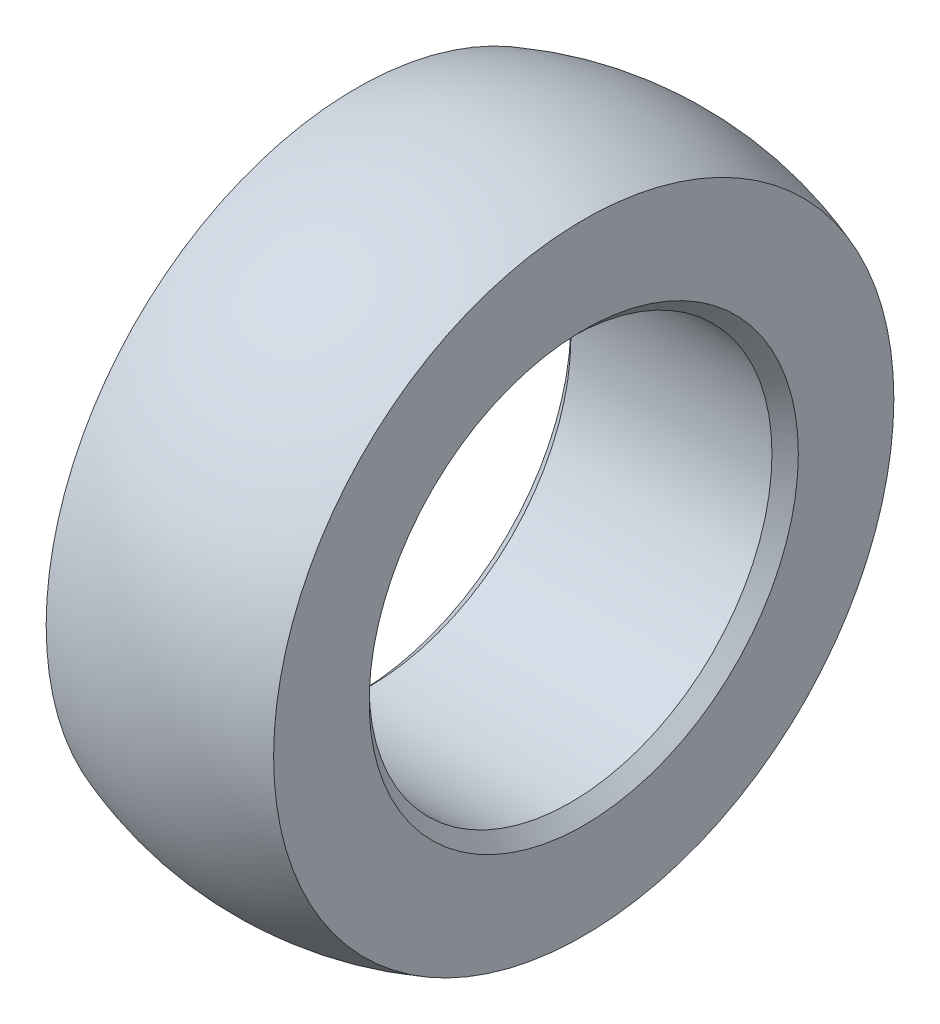
ISO-10303-21;
HEADER;
FILE_DESCRIPTION(('STEP AP214'),'2;1');
FILE_NAME('part.step','',(''),(''),'','','');
FILE_SCHEMA(('AUTOMOTIVE_DESIGN { 1 0 10303 214 1 1 1 1 }'));
ENDSEC;
DATA;
#1=APPLICATION_CONTEXT('core data for automotive mechanical design processes');
#2=APPLICATION_PROTOCOL_DEFINITION('international standard','automotive_design',2000,#1);
#3=PRODUCT_CONTEXT('',#1,'mechanical');
#4=PRODUCT('Part','Part','',(#3));
#5=PRODUCT_RELATED_PRODUCT_CATEGORY('part','',(#4));
#6=PRODUCT_DEFINITION_FORMATION('','',#4);
#7=PRODUCT_DEFINITION_CONTEXT('part definition',#1,'design');
#8=PRODUCT_DEFINITION('design','',#6,#7);
#9=PRODUCT_DEFINITION_SHAPE('','',#8);
#10=(LENGTH_UNIT() NAMED_UNIT(*) SI_UNIT(.MILLI.,.METRE.));
#11=(NAMED_UNIT(*) PLANE_ANGLE_UNIT() SI_UNIT($,.RADIAN.));
#12=(NAMED_UNIT(*) SI_UNIT($,.STERADIAN.) SOLID_ANGLE_UNIT());
#13=UNCERTAINTY_MEASURE_WITH_UNIT(LENGTH_MEASURE(1.E-05),#10,'distance_accuracy_value','');
#14=(GEOMETRIC_REPRESENTATION_CONTEXT(3) GLOBAL_UNCERTAINTY_ASSIGNED_CONTEXT((#13)) GLOBAL_UNIT_ASSIGNED_CONTEXT((#10,
#11,#12)) REPRESENTATION_CONTEXT('',''));
#15=CARTESIAN_POINT('',(0.,0.,0.));
#16=DIRECTION('',(0.,0.,1.));
#17=DIRECTION('',(1.,0.,0.));
#18=AXIS2_PLACEMENT_3D('',#15,#16,#17);
#19=CARTESIAN_POINT('',(4.3815,-12.0906797048,-12.0906797048));
#20=DIRECTION('',(-1.,0.,0.));
#21=DIRECTION('',(0.,0.,1.));
#22=AXIS2_PLACEMENT_3D('',#19,#20,#21);
#23=PLANE('',#22);
#24=CARTESIAN_POINT('',(4.38149999999993,0.,0.));
#25=DIRECTION('',(1.,0.,0.));
#26=DIRECTION('',(0.,0.,-1.));
#27=AXIS2_PLACEMENT_3D('',#24,#25,#26);
#28=CIRCLE('',#27,8.26769999999993);
#29=CARTESIAN_POINT('',(4.38149999999993,0.,-8.26769999999993));
#30=VERTEX_POINT('',#29);
#31=EDGE_CURVE('E18',#30,#30,#28,.T.);
#32=ORIENTED_EDGE('',*,*,#31,.F.);
#33=EDGE_LOOP('',(#32));
#34=FACE_BOUND('',#33,.T.);
#35=CARTESIAN_POINT('',(4.3815,0.,0.));
#36=DIRECTION('',(-1.,0.,0.));
#37=DIRECTION('',(0.,0.,1.));
#38=AXIS2_PLACEMENT_3D('',#35,#36,#37);
#39=CIRCLE('',#38,11.9473119533224);
#40=CARTESIAN_POINT('',(4.3815,0.,11.9473119533224));
#41=VERTEX_POINT('',#40);
#42=EDGE_CURVE('E33',#41,#41,#39,.F.);
#43=ORIENTED_EDGE('',*,*,#42,.T.);
#44=EDGE_LOOP('',(#43));
#45=FACE_BOUND('',#44,.T.);
#46=ADVANCED_FACE('F14',(#34,#45),#23,.F.);
#47=CARTESIAN_POINT('',(3.8735,0.,0.));
#48=DIRECTION('',(1.,0.,0.));
#49=DIRECTION('',(0.,0.,-1.));
#50=AXIS2_PLACEMENT_3D('',#47,#48,#49);
#51=CONICAL_SURFACE('',#50,7.7597,0.785398163397449);
#52=ORIENTED_EDGE('',*,*,#31,.T.);
#53=EDGE_LOOP('',(#52));
#54=FACE_BOUND('',#53,.T.);
#55=CARTESIAN_POINT('',(3.8735,0.,0.));
#56=DIRECTION('',(-1.,0.,0.));
#57=DIRECTION('',(0.,0.,1.));
#58=AXIS2_PLACEMENT_3D('',#55,#56,#57);
#59=CIRCLE('',#58,7.7597);
#60=CARTESIAN_POINT('',(3.8735,0.,7.7597));
#61=VERTEX_POINT('',#60);
#62=EDGE_CURVE('E31',#61,#61,#59,.F.);
#63=ORIENTED_EDGE('',*,*,#62,.F.);
#64=EDGE_LOOP('',(#63));
#65=FACE_BOUND('',#64,.T.);
#66=ADVANCED_FACE('F41',(#54,#65),#51,.F.);
#67=CARTESIAN_POINT('',(0.,0.,0.));
#68=DIRECTION('',(-1.,0.,0.));
#69=DIRECTION('',(0.,-1.,0.));
#70=AXIS2_PLACEMENT_3D('',#67,#68,#69);
#71=SPHERICAL_SURFACE('',#70,12.7254);
#72=CARTESIAN_POINT('',(-4.3815,0.,0.));
#73=DIRECTION('',(-1.,0.,0.));
#74=DIRECTION('',(0.,0.,1.));
#75=AXIS2_PLACEMENT_3D('',#72,#73,#74);
#76=CIRCLE('',#75,11.9473119533224);
#77=CARTESIAN_POINT('',(-4.3815,0.,11.9473119533224));
#78=VERTEX_POINT('',#77);
#79=EDGE_CURVE('E27',#78,#78,#76,.F.);
#80=ORIENTED_EDGE('',*,*,#79,.T.);
#81=EDGE_LOOP('',(#80));
#82=FACE_BOUND('',#81,.T.);
#83=ORIENTED_EDGE('',*,*,#42,.F.);
#84=EDGE_LOOP('',(#83));
#85=FACE_BOUND('',#84,.T.);
#86=ADVANCED_FACE('F49',(#82,#85),#71,.T.);
#87=CARTESIAN_POINT('',(3.8735,0.,0.));
#88=DIRECTION('',(-1.,0.,0.));
#89=DIRECTION('',(0.,0.,1.));
#90=AXIS2_PLACEMENT_3D('',#87,#88,#89);
#91=CYLINDRICAL_SURFACE('',#90,7.7597);
#92=CARTESIAN_POINT('',(-3.87349999999997,0.,0.));
#93=DIRECTION('',(-1.,0.,0.));
#94=DIRECTION('',(0.,0.,1.));
#95=AXIS2_PLACEMENT_3D('',#92,#93,#94);
#96=CIRCLE('',#95,7.7597);
#97=CARTESIAN_POINT('',(-3.8735,0.,7.7597));
#98=VERTEX_POINT('',#97);
#99=EDGE_CURVE('E22',#98,#98,#96,.F.);
#100=ORIENTED_EDGE('',*,*,#99,.F.);
#101=EDGE_LOOP('',(#100));
#102=FACE_BOUND('',#101,.T.);
#103=ORIENTED_EDGE('',*,*,#62,.T.);
#104=EDGE_LOOP('',(#103));
#105=FACE_BOUND('',#104,.T.);
#106=ADVANCED_FACE('F58',(#102,#105),#91,.F.);
#107=CARTESIAN_POINT('',(-4.3815,-12.0906797048,12.0906797048));
#108=DIRECTION('',(1.,0.,0.));
#109=DIRECTION('',(0.,0.,-1.));
#110=AXIS2_PLACEMENT_3D('',#107,#108,#109);
#111=PLANE('',#110);
#112=CARTESIAN_POINT('',(-4.38150000000004,0.,0.));
#113=DIRECTION('',(-1.,0.,0.));
#114=DIRECTION('',(0.,0.,1.));
#115=AXIS2_PLACEMENT_3D('',#112,#113,#114);
#116=CIRCLE('',#115,8.26770000000004);
#117=CARTESIAN_POINT('',(-4.38150000000004,0.,8.26770000000004));
#118=VERTEX_POINT('',#117);
#119=EDGE_CURVE('E10',#118,#118,#116,.T.);
#120=ORIENTED_EDGE('',*,*,#119,.F.);
#121=EDGE_LOOP('',(#120));
#122=FACE_BOUND('',#121,.T.);
#123=ORIENTED_EDGE('',*,*,#79,.F.);
#124=EDGE_LOOP('',(#123));
#125=FACE_BOUND('',#124,.T.);
#126=ADVANCED_FACE('F16',(#122,#125),#111,.F.);
#127=CARTESIAN_POINT('',(-3.8735,0.,0.));
#128=DIRECTION('',(-1.,0.,0.));
#129=DIRECTION('',(0.,0.,1.));
#130=AXIS2_PLACEMENT_3D('',#127,#128,#129);
#131=CONICAL_SURFACE('',#130,7.7597,0.785398163397449);
#132=ORIENTED_EDGE('',*,*,#99,.T.);
#133=EDGE_LOOP('',(#132));
#134=FACE_BOUND('',#133,.T.);
#135=ORIENTED_EDGE('',*,*,#119,.T.);
#136=EDGE_LOOP('',(#135));
#137=FACE_BOUND('',#136,.T.);
#138=ADVANCED_FACE('F51',(#134,#137),#131,.F.);
#139=CLOSED_SHELL('',(#46,#66,#86,#106,#126,#138));
#140=MANIFOLD_SOLID_BREP('B1',#139);
#141=ADVANCED_BREP_SHAPE_REPRESENTATION('',(#18,#140),#14);
#142=SHAPE_DEFINITION_REPRESENTATION(#9,#141);
ENDSEC;
END-ISO-10303-21;
